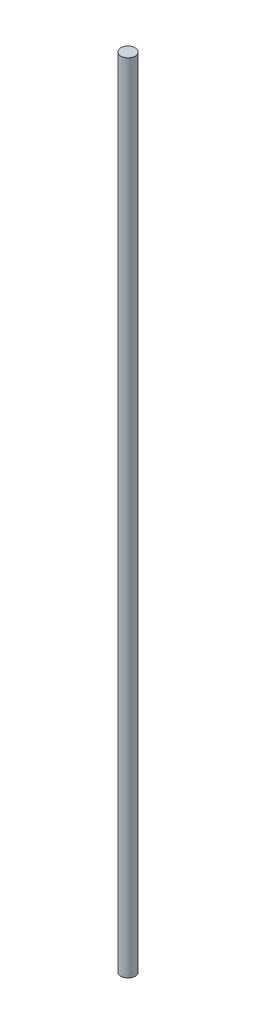
ISO-10303-21;
HEADER;
FILE_DESCRIPTION(('STEP AP214'),'2;1');
FILE_NAME('part.step','',(''),(''),'','','');
FILE_SCHEMA(('AUTOMOTIVE_DESIGN { 1 0 10303 214 1 1 1 1 }'));
ENDSEC;
DATA;
#1=APPLICATION_CONTEXT('core data for automotive mechanical design processes');
#2=APPLICATION_PROTOCOL_DEFINITION('international standard','automotive_design',2000,#1);
#3=PRODUCT_CONTEXT('',#1,'mechanical');
#4=PRODUCT('Part','Part','',(#3));
#5=PRODUCT_RELATED_PRODUCT_CATEGORY('part','',(#4));
#6=PRODUCT_DEFINITION_FORMATION('','',#4);
#7=PRODUCT_DEFINITION_CONTEXT('part definition',#1,'design');
#8=PRODUCT_DEFINITION('design','',#6,#7);
#9=PRODUCT_DEFINITION_SHAPE('','',#8);
#10=(LENGTH_UNIT() NAMED_UNIT(*) SI_UNIT(.MILLI.,.METRE.));
#11=(NAMED_UNIT(*) PLANE_ANGLE_UNIT() SI_UNIT($,.RADIAN.));
#12=(NAMED_UNIT(*) SI_UNIT($,.STERADIAN.) SOLID_ANGLE_UNIT());
#13=UNCERTAINTY_MEASURE_WITH_UNIT(LENGTH_MEASURE(1.E-05),#10,'distance_accuracy_value','');
#14=(GEOMETRIC_REPRESENTATION_CONTEXT(3) GLOBAL_UNCERTAINTY_ASSIGNED_CONTEXT((#13)) GLOBAL_UNIT_ASSIGNED_CONTEXT((#10,
#11,#12)) REPRESENTATION_CONTEXT('',''));
#15=CARTESIAN_POINT('',(0.,0.,0.));
#16=DIRECTION('',(0.,0.,1.));
#17=DIRECTION('',(1.,0.,0.));
#18=AXIS2_PLACEMENT_3D('',#15,#16,#17);
#19=CARTESIAN_POINT('',(0.,440.,0.));
#20=DIRECTION('',(0.,-1.,0.));
#21=DIRECTION('',(0.,0.,-1.));
#22=AXIS2_PLACEMENT_3D('',#19,#20,#21);
#23=CYLINDRICAL_SURFACE('',#22,4.);
#24=CARTESIAN_POINT('',(0.,440.,0.));
#25=DIRECTION('',(0.,1.,0.));
#26=DIRECTION('',(0.,0.,1.));
#27=AXIS2_PLACEMENT_3D('',#24,#25,#26);
#28=CIRCLE('',#27,4.);
#29=CARTESIAN_POINT('',(0.,440.,4.));
#30=VERTEX_POINT('',#29);
#31=EDGE_CURVE('E10',#30,#30,#28,.T.);
#32=ORIENTED_EDGE('',*,*,#31,.F.);
#33=EDGE_LOOP('',(#32));
#34=FACE_BOUND('',#33,.T.);
#35=CARTESIAN_POINT('',(0.,0.,0.));
#36=DIRECTION('',(0.,1.,0.));
#37=DIRECTION('',(0.,0.,1.));
#38=AXIS2_PLACEMENT_3D('',#35,#36,#37);
#39=CIRCLE('',#38,4.);
#40=CARTESIAN_POINT('',(0.,0.,4.));
#41=VERTEX_POINT('',#40);
#42=EDGE_CURVE('E36',#41,#41,#39,.T.);
#43=ORIENTED_EDGE('',*,*,#42,.T.);
#44=EDGE_LOOP('',(#43));
#45=FACE_BOUND('',#44,.T.);
#46=ADVANCED_FACE('F33',(#34,#45),#23,.T.);
#47=CARTESIAN_POINT('',(0.,440.,0.));
#48=DIRECTION('',(0.,1.,0.));
#49=DIRECTION('',(0.,0.,1.));
#50=AXIS2_PLACEMENT_3D('',#47,#48,#49);
#51=PLANE('',#50);
#52=ORIENTED_EDGE('',*,*,#31,.T.);
#53=EDGE_LOOP('',(#52));
#54=FACE_BOUND('',#53,.T.);
#55=ADVANCED_FACE('F48',(#54),#51,.T.);
#56=CARTESIAN_POINT('',(0.,0.,0.));
#57=DIRECTION('',(0.,1.,0.));
#58=DIRECTION('',(0.,0.,1.));
#59=AXIS2_PLACEMENT_3D('',#56,#57,#58);
#60=PLANE('',#59);
#61=ORIENTED_EDGE('',*,*,#42,.F.);
#62=EDGE_LOOP('',(#61));
#63=FACE_BOUND('',#62,.T.);
#64=ADVANCED_FACE('F46',(#63),#60,.F.);
#65=CLOSED_SHELL('',(#46,#55,#64));
#66=MANIFOLD_SOLID_BREP('B2',#65);
#67=ADVANCED_BREP_SHAPE_REPRESENTATION('',(#18,#66),#14);
#68=SHAPE_DEFINITION_REPRESENTATION(#9,#67);
ENDSEC;
END-ISO-10303-21;
